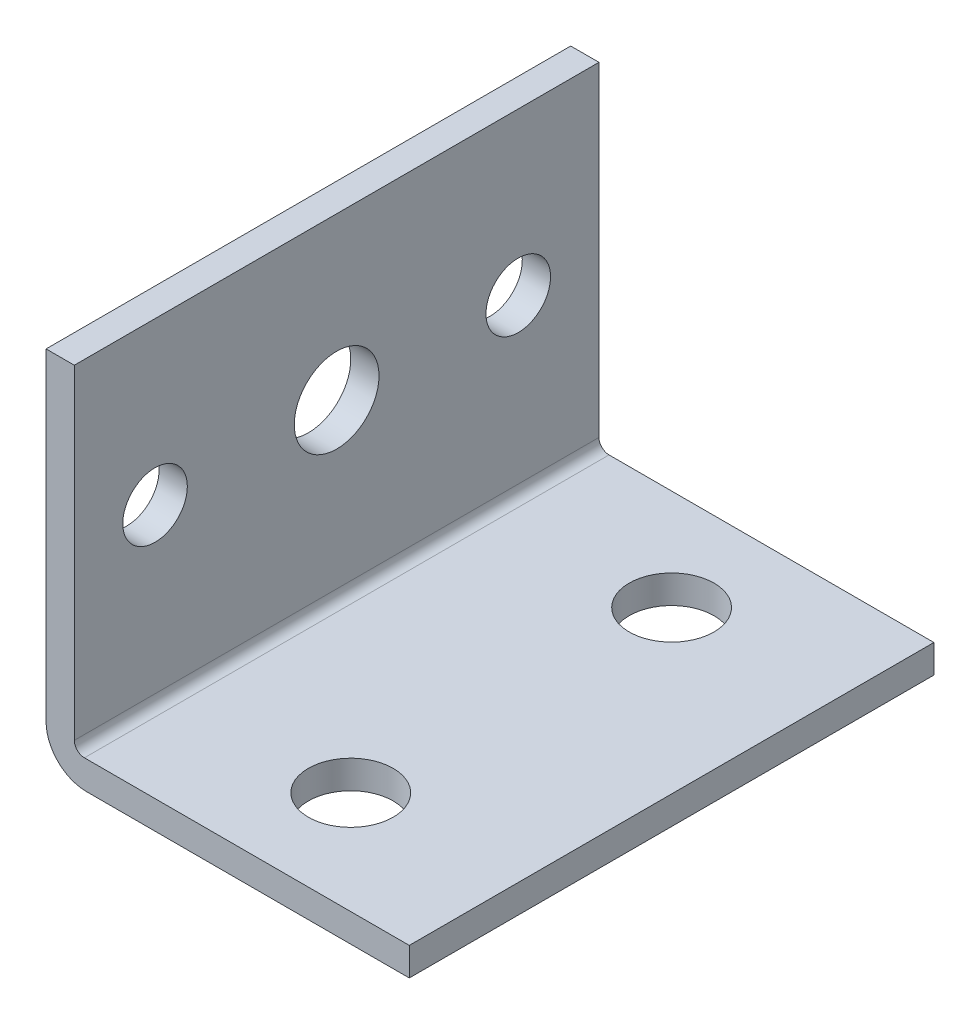
ISO-10303-21;
HEADER;
FILE_DESCRIPTION(('STEP AP214'),'2;1');
FILE_NAME('part.step','',(''),(''),'','','');
FILE_SCHEMA(('AUTOMOTIVE_DESIGN { 1 0 10303 214 1 1 1 1 }'));
ENDSEC;
DATA;
#1=APPLICATION_CONTEXT('core data for automotive mechanical design processes');
#2=APPLICATION_PROTOCOL_DEFINITION('international standard','automotive_design',2000,#1);
#3=PRODUCT_CONTEXT('',#1,'mechanical');
#4=PRODUCT('Part','Part','',(#3));
#5=PRODUCT_RELATED_PRODUCT_CATEGORY('part','',(#4));
#6=PRODUCT_DEFINITION_FORMATION('','',#4);
#7=PRODUCT_DEFINITION_CONTEXT('part definition',#1,'design');
#8=PRODUCT_DEFINITION('design','',#6,#7);
#9=PRODUCT_DEFINITION_SHAPE('','',#8);
#10=(LENGTH_UNIT() NAMED_UNIT(*) SI_UNIT(.MILLI.,.METRE.));
#11=(NAMED_UNIT(*) PLANE_ANGLE_UNIT() SI_UNIT($,.RADIAN.));
#12=(NAMED_UNIT(*) SI_UNIT($,.STERADIAN.) SOLID_ANGLE_UNIT());
#13=UNCERTAINTY_MEASURE_WITH_UNIT(LENGTH_MEASURE(1.E-05),#10,'distance_accuracy_value','');
#14=(GEOMETRIC_REPRESENTATION_CONTEXT(3) GLOBAL_UNCERTAINTY_ASSIGNED_CONTEXT((#13)) GLOBAL_UNIT_ASSIGNED_CONTEXT((#10,
#11,#12)) REPRESENTATION_CONTEXT('',''));
#15=CARTESIAN_POINT('',(0.,0.,0.));
#16=DIRECTION('',(0.,0.,1.));
#17=DIRECTION('',(1.,0.,0.));
#18=AXIS2_PLACEMENT_3D('',#15,#16,#17);
#19=CARTESIAN_POINT('',(0.,-15.7109360589494,-66.04));
#20=DIRECTION('',(0.,-1.,0.));
#21=DIRECTION('',(0.,0.,-1.));
#22=AXIS2_PLACEMENT_3D('',#19,#20,#21);
#23=PLANE('',#22);
#24=CARTESIAN_POINT('',(4.76580936534349,-15.7109360589494,-53.34));
#25=DIRECTION('',(0.,-1.,0.));
#26=DIRECTION('',(0.,0.,-1.));
#27=AXIS2_PLACEMENT_3D('',#24,#25,#26);
#28=CIRCLE('',#27,5.334);
#29=CARTESIAN_POINT('',(4.76580936534349,-15.7109360589494,-58.674));
#30=VERTEX_POINT('',#29);
#31=EDGE_CURVE('E263',#30,#30,#28,.T.);
#32=ORIENTED_EDGE('',*,*,#31,.T.);
#33=EDGE_LOOP('',(#32));
#34=FACE_BOUND('',#33,.T.);
#35=CARTESIAN_POINT('',(4.76580936534349,-15.7109360589494,-12.954));
#36=DIRECTION('',(0.,-1.,0.));
#37=DIRECTION('',(0.,0.,-1.));
#38=AXIS2_PLACEMENT_3D('',#35,#36,#37);
#39=CIRCLE('',#38,5.334);
#40=CARTESIAN_POINT('',(4.76580936534349,-15.7109360589494,-18.288));
#41=VERTEX_POINT('',#40);
#42=EDGE_CURVE('E163',#41,#41,#39,.T.);
#43=ORIENTED_EDGE('',*,*,#42,.T.);
#44=EDGE_LOOP('',(#43));
#45=FACE_BOUND('',#44,.T.);
#46=DIRECTION('',(1.,0.,0.));
#47=VECTOR('',#46,1.);
#48=CARTESIAN_POINT('',(0.,-15.7109360589494,-66.04));
#49=LINE('',#48,#47);
#50=CARTESIAN_POINT('',(-15.8081906346565,-15.7109360589494,-66.04));
#51=VERTEX_POINT('',#50);
#52=CARTESIAN_POINT('',(25.0858093653435,-15.7109360589494,-66.04));
#53=VERTEX_POINT('',#52);
#54=EDGE_CURVE('E111',#51,#53,#49,.T.);
#55=ORIENTED_EDGE('',*,*,#54,.F.);
#56=DIRECTION('',(0.,0.,1.));
#57=VECTOR('',#56,1.);
#58=CARTESIAN_POINT('',(-15.8081906346565,-15.7109360589494,-66.04));
#59=LINE('',#58,#57);
#60=CARTESIAN_POINT('',(-15.8081906346565,-15.7109360589494,0.));
#61=VERTEX_POINT('',#60);
#62=EDGE_CURVE('E133',#51,#61,#59,.T.);
#63=ORIENTED_EDGE('',*,*,#62,.T.);
#64=DIRECTION('',(1.,0.,0.));
#65=VECTOR('',#64,1.);
#66=CARTESIAN_POINT('',(0.,-15.7109360589494,0.));
#67=LINE('',#66,#65);
#68=CARTESIAN_POINT('',(25.0858093653435,-15.7109360589494,0.));
#69=VERTEX_POINT('',#68);
#70=EDGE_CURVE('E149',#61,#69,#67,.T.);
#71=ORIENTED_EDGE('',*,*,#70,.T.);
#72=DIRECTION('',(0.,0.,1.));
#73=VECTOR('',#72,1.);
#74=CARTESIAN_POINT('',(25.0858093653435,-15.7109360589494,-66.04));
#75=LINE('',#74,#73);
#76=EDGE_CURVE('E136',#53,#69,#75,.T.);
#77=ORIENTED_EDGE('',*,*,#76,.F.);
#78=EDGE_LOOP('',(#55,#63,#71,#77));
#79=FACE_BOUND('',#78,.T.);
#80=ADVANCED_FACE('F34',(#34,#45,#79),#23,.F.);
#81=CARTESIAN_POINT('',(25.0858093653435,0.,-66.04));
#82=DIRECTION('',(1.,0.,0.));
#83=DIRECTION('',(0.,0.,-1.));
#84=AXIS2_PLACEMENT_3D('',#81,#82,#83);
#85=PLANE('',#84);
#86=DIRECTION('',(0.,1.,0.));
#87=VECTOR('',#86,1.);
#88=CARTESIAN_POINT('',(25.0858093653435,0.,0.));
#89=LINE('',#88,#87);
#90=CARTESIAN_POINT('',(25.0858093653435,-19.2669360589494,0.));
#91=VERTEX_POINT('',#90);
#92=EDGE_CURVE('E170',#91,#69,#89,.T.);
#93=ORIENTED_EDGE('',*,*,#92,.F.);
#94=DIRECTION('',(0.,0.,1.));
#95=VECTOR('',#94,1.);
#96=CARTESIAN_POINT('',(25.0858093653435,-19.2669360589494,-66.04));
#97=LINE('',#96,#95);
#98=CARTESIAN_POINT('',(25.0858093653435,-19.2669360589494,-66.04));
#99=VERTEX_POINT('',#98);
#100=EDGE_CURVE('E126',#99,#91,#97,.T.);
#101=ORIENTED_EDGE('',*,*,#100,.F.);
#102=DIRECTION('',(0.,1.,0.));
#103=VECTOR('',#102,1.);
#104=CARTESIAN_POINT('',(25.0858093653435,0.,-66.04));
#105=LINE('',#104,#103);
#106=EDGE_CURVE('E124',#99,#53,#105,.T.);
#107=ORIENTED_EDGE('',*,*,#106,.T.);
#108=ORIENTED_EDGE('',*,*,#76,.T.);
#109=EDGE_LOOP('',(#93,#101,#107,#108));
#110=FACE_BOUND('',#109,.T.);
#111=ADVANCED_FACE('F191',(#110),#85,.T.);
#112=CARTESIAN_POINT('',(0.,-19.2669360589494,-66.04));
#113=DIRECTION('',(0.,-1.,0.));
#114=DIRECTION('',(0.,0.,-1.));
#115=AXIS2_PLACEMENT_3D('',#112,#113,#114);
#116=PLANE('',#115);
#117=CARTESIAN_POINT('',(4.76580936534349,-19.2669360589494,-53.34));
#118=DIRECTION('',(0.,-1.,0.));
#119=DIRECTION('',(0.,0.,-1.));
#120=AXIS2_PLACEMENT_3D('',#117,#118,#119);
#121=CIRCLE('',#120,5.334);
#122=CARTESIAN_POINT('',(4.76580936534349,-19.2669360589494,-58.674));
#123=VERTEX_POINT('',#122);
#124=EDGE_CURVE('E261',#123,#123,#121,.T.);
#125=ORIENTED_EDGE('',*,*,#124,.F.);
#126=EDGE_LOOP('',(#125));
#127=FACE_BOUND('',#126,.T.);
#128=CARTESIAN_POINT('',(4.76580936534349,-19.2669360589494,-12.954));
#129=DIRECTION('',(0.,-1.,0.));
#130=DIRECTION('',(0.,0.,-1.));
#131=AXIS2_PLACEMENT_3D('',#128,#129,#130);
#132=CIRCLE('',#131,5.334);
#133=CARTESIAN_POINT('',(4.76580936534349,-19.2669360589494,-18.288));
#134=VERTEX_POINT('',#133);
#135=EDGE_CURVE('E264',#134,#134,#132,.T.);
#136=ORIENTED_EDGE('',*,*,#135,.F.);
#137=EDGE_LOOP('',(#136));
#138=FACE_BOUND('',#137,.T.);
#139=DIRECTION('',(1.,0.,0.));
#140=VECTOR('',#139,1.);
#141=CARTESIAN_POINT('',(0.,-19.2669360589494,0.));
#142=LINE('',#141,#140);
#143=CARTESIAN_POINT('',(-15.5541906346565,-19.2669360589494,0.));
#144=VERTEX_POINT('',#143);
#145=EDGE_CURVE('E180',#144,#91,#142,.T.);
#146=ORIENTED_EDGE('',*,*,#145,.F.);
#147=DIRECTION('',(0.,0.,1.));
#148=VECTOR('',#147,1.);
#149=CARTESIAN_POINT('',(-15.5541906346565,-19.2669360589494,-66.04));
#150=LINE('',#149,#148);
#151=CARTESIAN_POINT('',(-15.5541906346565,-19.2669360589494,-66.04));
#152=VERTEX_POINT('',#151);
#153=EDGE_CURVE('E43',#144,#152,#150,.F.);
#154=ORIENTED_EDGE('',*,*,#153,.T.);
#155=DIRECTION('',(1.,0.,0.));
#156=VECTOR('',#155,1.);
#157=CARTESIAN_POINT('',(0.,-19.2669360589494,-66.04));
#158=LINE('',#157,#156);
#159=EDGE_CURVE('E129',#152,#99,#158,.T.);
#160=ORIENTED_EDGE('',*,*,#159,.T.);
#161=ORIENTED_EDGE('',*,*,#100,.T.);
#162=EDGE_LOOP('',(#146,#154,#160,#161));
#163=FACE_BOUND('',#162,.T.);
#164=ADVANCED_FACE('F188',(#127,#138,#163),#116,.T.);
#165=CARTESIAN_POINT('',(-20.6341906346565,0.,-66.04));
#166=DIRECTION('',(-1.,0.,0.));
#167=DIRECTION('',(0.,-1.,0.));
#168=AXIS2_PLACEMENT_3D('',#165,#166,#167);
#169=PLANE('',#168);
#170=CARTESIAN_POINT('',(-20.6341906346565,6.13306394105061,-55.88));
#171=DIRECTION('',(-1.,0.,0.));
#172=DIRECTION('',(0.,-1.,0.));
#173=AXIS2_PLACEMENT_3D('',#170,#171,#172);
#174=CIRCLE('',#173,4.064);
#175=CARTESIAN_POINT('',(-20.6341906346565,2.06906394105061,-55.88));
#176=VERTEX_POINT('',#175);
#177=EDGE_CURVE('E153',#176,#176,#174,.T.);
#178=ORIENTED_EDGE('',*,*,#177,.F.);
#179=EDGE_LOOP('',(#178));
#180=FACE_BOUND('',#179,.T.);
#181=CARTESIAN_POINT('',(-20.6341906346565,6.13306394105061,-10.16));
#182=DIRECTION('',(-1.,0.,0.));
#183=DIRECTION('',(0.,-1.,0.));
#184=AXIS2_PLACEMENT_3D('',#181,#182,#183);
#185=CIRCLE('',#184,4.064);
#186=CARTESIAN_POINT('',(-20.6341906346565,2.06906394105061,-10.16));
#187=VERTEX_POINT('',#186);
#188=EDGE_CURVE('E158',#187,#187,#185,.T.);
#189=ORIENTED_EDGE('',*,*,#188,.F.);
#190=EDGE_LOOP('',(#189));
#191=FACE_BOUND('',#190,.T.);
#192=CARTESIAN_POINT('',(-20.6341906346565,6.13306394105061,-33.02));
#193=DIRECTION('',(-1.,0.,0.));
#194=DIRECTION('',(0.,-1.,0.));
#195=AXIS2_PLACEMENT_3D('',#192,#193,#194);
#196=CIRCLE('',#195,5.334);
#197=CARTESIAN_POINT('',(-20.6341906346565,0.799063941050615,-33.02));
#198=VERTEX_POINT('',#197);
#199=EDGE_CURVE('E150',#198,#198,#196,.T.);
#200=ORIENTED_EDGE('',*,*,#199,.F.);
#201=EDGE_LOOP('',(#200));
#202=FACE_BOUND('',#201,.T.);
#203=DIRECTION('',(0.,-1.,0.));
#204=VECTOR('',#203,1.);
#205=CARTESIAN_POINT('',(-20.6341906346565,0.,-66.04));
#206=LINE('',#205,#204);
#207=CARTESIAN_POINT('',(-20.6341906346565,26.4530639410506,-66.04));
#208=VERTEX_POINT('',#207);
#209=CARTESIAN_POINT('',(-20.6341906346565,-14.1869360589494,-66.04));
#210=VERTEX_POINT('',#209);
#211=EDGE_CURVE('E117',#208,#210,#206,.T.);
#212=ORIENTED_EDGE('',*,*,#211,.T.);
#213=DIRECTION('',(0.,0.,1.));
#214=VECTOR('',#213,1.);
#215=CARTESIAN_POINT('',(-20.6341906346565,-14.1869360589494,-66.04));
#216=LINE('',#215,#214);
#217=CARTESIAN_POINT('',(-20.6341906346565,-14.1869360589494,0.));
#218=VERTEX_POINT('',#217);
#219=EDGE_CURVE('E142',#210,#218,#216,.T.);
#220=ORIENTED_EDGE('',*,*,#219,.T.);
#221=DIRECTION('',(0.,-1.,0.));
#222=VECTOR('',#221,1.);
#223=CARTESIAN_POINT('',(-20.6341906346565,0.,0.));
#224=LINE('',#223,#222);
#225=CARTESIAN_POINT('',(-20.6341906346565,26.4530639410506,0.));
#226=VERTEX_POINT('',#225);
#227=EDGE_CURVE('E178',#226,#218,#224,.T.);
#228=ORIENTED_EDGE('',*,*,#227,.F.);
#229=DIRECTION('',(0.,0.,1.));
#230=VECTOR('',#229,1.);
#231=CARTESIAN_POINT('',(-20.6341906346565,26.4530639410506,-66.04));
#232=LINE('',#231,#230);
#233=EDGE_CURVE('E123',#208,#226,#232,.T.);
#234=ORIENTED_EDGE('',*,*,#233,.F.);
#235=EDGE_LOOP('',(#212,#220,#228,#234));
#236=FACE_BOUND('',#235,.T.);
#237=ADVANCED_FACE('F205',(#180,#191,#202,#236),#169,.T.);
#238=CARTESIAN_POINT('',(0.,26.4530639410506,-66.04));
#239=DIRECTION('',(0.,-1.,0.));
#240=DIRECTION('',(0.,0.,-1.));
#241=AXIS2_PLACEMENT_3D('',#238,#239,#240);
#242=PLANE('',#241);
#243=DIRECTION('',(1.,0.,0.));
#244=VECTOR('',#243,1.);
#245=CARTESIAN_POINT('',(0.,26.4530639410506,0.));
#246=LINE('',#245,#244);
#247=CARTESIAN_POINT('',(-17.0781906346565,26.4530639410506,0.));
#248=VERTEX_POINT('',#247);
#249=EDGE_CURVE('E122',#226,#248,#246,.T.);
#250=ORIENTED_EDGE('',*,*,#249,.T.);
#251=DIRECTION('',(0.,0.,1.));
#252=VECTOR('',#251,1.);
#253=CARTESIAN_POINT('',(-17.0781906346565,26.4530639410506,-66.04));
#254=LINE('',#253,#252);
#255=CARTESIAN_POINT('',(-17.0781906346565,26.4530639410506,-66.04));
#256=VERTEX_POINT('',#255);
#257=EDGE_CURVE('E104',#256,#248,#254,.T.);
#258=ORIENTED_EDGE('',*,*,#257,.F.);
#259=DIRECTION('',(1.,0.,0.));
#260=VECTOR('',#259,1.);
#261=CARTESIAN_POINT('',(0.,26.4530639410506,-66.04));
#262=LINE('',#261,#260);
#263=EDGE_CURVE('E110',#208,#256,#262,.T.);
#264=ORIENTED_EDGE('',*,*,#263,.F.);
#265=ORIENTED_EDGE('',*,*,#233,.T.);
#266=EDGE_LOOP('',(#250,#258,#264,#265));
#267=FACE_BOUND('',#266,.T.);
#268=ADVANCED_FACE('F120',(#267),#242,.F.);
#269=CARTESIAN_POINT('',(-17.0781906346565,0.,-66.04));
#270=DIRECTION('',(1.,0.,0.));
#271=DIRECTION('',(0.,0.,-1.));
#272=AXIS2_PLACEMENT_3D('',#269,#270,#271);
#273=PLANE('',#272);
#274=CARTESIAN_POINT('',(-17.0781906346565,6.13306394105061,-55.88));
#275=DIRECTION('',(1.,0.,0.));
#276=DIRECTION('',(0.,0.,-1.));
#277=AXIS2_PLACEMENT_3D('',#274,#275,#276);
#278=CIRCLE('',#277,4.064);
#279=CARTESIAN_POINT('',(-17.0781906346565,6.13306394105061,-59.944));
#280=VERTEX_POINT('',#279);
#281=EDGE_CURVE('E38',#280,#280,#278,.T.);
#282=ORIENTED_EDGE('',*,*,#281,.F.);
#283=EDGE_LOOP('',(#282));
#284=FACE_BOUND('',#283,.T.);
#285=CARTESIAN_POINT('',(-17.0781906346565,6.13306394105061,-10.16));
#286=DIRECTION('',(1.,0.,0.));
#287=DIRECTION('',(0.,0.,-1.));
#288=AXIS2_PLACEMENT_3D('',#285,#286,#287);
#289=CIRCLE('',#288,4.064);
#290=CARTESIAN_POINT('',(-17.0781906346565,6.13306394105061,-14.224));
#291=VERTEX_POINT('',#290);
#292=EDGE_CURVE('E151',#291,#291,#289,.T.);
#293=ORIENTED_EDGE('',*,*,#292,.F.);
#294=EDGE_LOOP('',(#293));
#295=FACE_BOUND('',#294,.T.);
#296=CARTESIAN_POINT('',(-17.0781906346565,6.13306394105061,-33.02));
#297=DIRECTION('',(1.,0.,0.));
#298=DIRECTION('',(0.,0.,-1.));
#299=AXIS2_PLACEMENT_3D('',#296,#297,#298);
#300=CIRCLE('',#299,5.334);
#301=CARTESIAN_POINT('',(-17.0781906346565,6.13306394105061,-38.354));
#302=VERTEX_POINT('',#301);
#303=EDGE_CURVE('E147',#302,#302,#300,.T.);
#304=ORIENTED_EDGE('',*,*,#303,.F.);
#305=EDGE_LOOP('',(#304));
#306=FACE_BOUND('',#305,.T.);
#307=DIRECTION('',(0.,1.,0.));
#308=VECTOR('',#307,1.);
#309=CARTESIAN_POINT('',(-17.0781906346565,0.,0.));
#310=LINE('',#309,#308);
#311=CARTESIAN_POINT('',(-17.0781906346565,-14.4409360589494,0.));
#312=VERTEX_POINT('',#311);
#313=EDGE_CURVE('E175',#312,#248,#310,.T.);
#314=ORIENTED_EDGE('',*,*,#313,.F.);
#315=DIRECTION('',(0.,0.,1.));
#316=VECTOR('',#315,1.);
#317=CARTESIAN_POINT('',(-17.0781906346565,-14.4409360589494,-66.04));
#318=LINE('',#317,#316);
#319=CARTESIAN_POINT('',(-17.0781906346565,-14.4409360589494,-66.04));
#320=VERTEX_POINT('',#319);
#321=EDGE_CURVE('E107',#312,#320,#318,.F.);
#322=ORIENTED_EDGE('',*,*,#321,.T.);
#323=DIRECTION('',(0.,1.,0.));
#324=VECTOR('',#323,1.);
#325=CARTESIAN_POINT('',(-17.0781906346565,0.,-66.04));
#326=LINE('',#325,#324);
#327=EDGE_CURVE('E99',#320,#256,#326,.T.);
#328=ORIENTED_EDGE('',*,*,#327,.T.);
#329=ORIENTED_EDGE('',*,*,#257,.T.);
#330=EDGE_LOOP('',(#314,#322,#328,#329));
#331=FACE_BOUND('',#330,.T.);
#332=ADVANCED_FACE('F102',(#284,#295,#306,#331),#273,.T.);
#333=CARTESIAN_POINT('',(0.,0.,-66.04));
#334=DIRECTION('',(0.,0.,1.));
#335=DIRECTION('',(1.,0.,0.));
#336=AXIS2_PLACEMENT_3D('',#333,#334,#335);
#337=PLANE('',#336);
#338=ORIENTED_EDGE('',*,*,#159,.F.);
#339=CARTESIAN_POINT('',(-15.5541906346565,-14.1869360589494,-66.04));
#340=DIRECTION('',(0.,0.,1.));
#341=DIRECTION('',(1.,0.,0.));
#342=AXIS2_PLACEMENT_3D('',#339,#340,#341);
#343=CIRCLE('',#342,5.08);
#344=EDGE_CURVE('E11',#152,#210,#343,.F.);
#345=ORIENTED_EDGE('',*,*,#344,.T.);
#346=ORIENTED_EDGE('',*,*,#211,.F.);
#347=ORIENTED_EDGE('',*,*,#263,.T.);
#348=ORIENTED_EDGE('',*,*,#327,.F.);
#349=CARTESIAN_POINT('',(-15.8081906346565,-14.4409360589494,-66.04));
#350=DIRECTION('',(0.,0.,1.));
#351=DIRECTION('',(1.,0.,0.));
#352=AXIS2_PLACEMENT_3D('',#349,#350,#351);
#353=CIRCLE('',#352,1.27);
#354=EDGE_CURVE('E140',#320,#51,#353,.T.);
#355=ORIENTED_EDGE('',*,*,#354,.T.);
#356=ORIENTED_EDGE('',*,*,#54,.T.);
#357=ORIENTED_EDGE('',*,*,#106,.F.);
#358=EDGE_LOOP('',(#338,#345,#346,#347,#348,#355,#356,#357));
#359=FACE_BOUND('',#358,.T.);
#360=ADVANCED_FACE('F115',(#359),#337,.F.);
#361=CARTESIAN_POINT('',(0.,0.,0.));
#362=DIRECTION('',(0.,0.,1.));
#363=DIRECTION('',(1.,0.,0.));
#364=AXIS2_PLACEMENT_3D('',#361,#362,#363);
#365=PLANE('',#364);
#366=ORIENTED_EDGE('',*,*,#227,.T.);
#367=CARTESIAN_POINT('',(-15.5541906346565,-14.1869360589494,0.));
#368=DIRECTION('',(0.,0.,1.));
#369=DIRECTION('',(1.,0.,0.));
#370=AXIS2_PLACEMENT_3D('',#367,#368,#369);
#371=CIRCLE('',#370,5.08);
#372=EDGE_CURVE('E58',#218,#144,#371,.T.);
#373=ORIENTED_EDGE('',*,*,#372,.T.);
#374=ORIENTED_EDGE('',*,*,#145,.T.);
#375=ORIENTED_EDGE('',*,*,#92,.T.);
#376=ORIENTED_EDGE('',*,*,#70,.F.);
#377=CARTESIAN_POINT('',(-15.8081906346565,-14.4409360589494,0.));
#378=DIRECTION('',(0.,0.,1.));
#379=DIRECTION('',(1.,0.,0.));
#380=AXIS2_PLACEMENT_3D('',#377,#378,#379);
#381=CIRCLE('',#380,1.27);
#382=EDGE_CURVE('E138',#61,#312,#381,.F.);
#383=ORIENTED_EDGE('',*,*,#382,.T.);
#384=ORIENTED_EDGE('',*,*,#313,.T.);
#385=ORIENTED_EDGE('',*,*,#249,.F.);
#386=EDGE_LOOP('',(#366,#373,#374,#375,#376,#383,#384,#385));
#387=FACE_BOUND('',#386,.T.);
#388=ADVANCED_FACE('F194',(#387),#365,.T.);
#389=CARTESIAN_POINT('',(-15.8081906346565,-14.4409360589494,-66.04));
#390=DIRECTION('',(0.,0.,1.));
#391=DIRECTION('',(1.,0.,0.));
#392=AXIS2_PLACEMENT_3D('',#389,#390,#391);
#393=CYLINDRICAL_SURFACE('',#392,1.27);
#394=ORIENTED_EDGE('',*,*,#354,.F.);
#395=ORIENTED_EDGE('',*,*,#321,.F.);
#396=ORIENTED_EDGE('',*,*,#382,.F.);
#397=ORIENTED_EDGE('',*,*,#62,.F.);
#398=EDGE_LOOP('',(#394,#395,#396,#397));
#399=FACE_BOUND('',#398,.T.);
#400=ADVANCED_FACE('F199',(#399),#393,.F.);
#401=CARTESIAN_POINT('',(-15.5541906346565,-14.1869360589494,-66.04));
#402=DIRECTION('',(0.,0.,1.));
#403=DIRECTION('',(1.,0.,0.));
#404=AXIS2_PLACEMENT_3D('',#401,#402,#403);
#405=CYLINDRICAL_SURFACE('',#404,5.08);
#406=ORIENTED_EDGE('',*,*,#344,.F.);
#407=ORIENTED_EDGE('',*,*,#153,.F.);
#408=ORIENTED_EDGE('',*,*,#372,.F.);
#409=ORIENTED_EDGE('',*,*,#219,.F.);
#410=EDGE_LOOP('',(#406,#407,#408,#409));
#411=FACE_BOUND('',#410,.T.);
#412=ADVANCED_FACE('F36',(#411),#405,.T.);
#413=CARTESIAN_POINT('',(45.4058093653435,6.13306394105062,-33.02));
#414=DIRECTION('',(-1.,0.,0.));
#415=DIRECTION('',(0.,-1.,0.));
#416=AXIS2_PLACEMENT_3D('',#413,#414,#415);
#417=CYLINDRICAL_SURFACE('',#416,5.334);
#418=ORIENTED_EDGE('',*,*,#303,.T.);
#419=EDGE_LOOP('',(#418));
#420=FACE_BOUND('',#419,.T.);
#421=ORIENTED_EDGE('',*,*,#199,.T.);
#422=EDGE_LOOP('',(#421));
#423=FACE_BOUND('',#422,.T.);
#424=ADVANCED_FACE('F232',(#420,#423),#417,.F.);
#425=CARTESIAN_POINT('',(45.4058093653435,6.13306394105062,-10.16));
#426=DIRECTION('',(-1.,0.,0.));
#427=DIRECTION('',(0.,-1.,0.));
#428=AXIS2_PLACEMENT_3D('',#425,#426,#427);
#429=CYLINDRICAL_SURFACE('',#428,4.064);
#430=ORIENTED_EDGE('',*,*,#292,.T.);
#431=EDGE_LOOP('',(#430));
#432=FACE_BOUND('',#431,.T.);
#433=ORIENTED_EDGE('',*,*,#188,.T.);
#434=EDGE_LOOP('',(#433));
#435=FACE_BOUND('',#434,.T.);
#436=ADVANCED_FACE('F241',(#432,#435),#429,.F.);
#437=CARTESIAN_POINT('',(45.4058093653435,6.13306394105062,-55.88));
#438=DIRECTION('',(-1.,0.,0.));
#439=DIRECTION('',(0.,-1.,0.));
#440=AXIS2_PLACEMENT_3D('',#437,#438,#439);
#441=CYLINDRICAL_SURFACE('',#440,4.064);
#442=ORIENTED_EDGE('',*,*,#281,.T.);
#443=EDGE_LOOP('',(#442));
#444=FACE_BOUND('',#443,.T.);
#445=ORIENTED_EDGE('',*,*,#177,.T.);
#446=EDGE_LOOP('',(#445));
#447=FACE_BOUND('',#446,.T.);
#448=ADVANCED_FACE('F245',(#444,#447),#441,.F.);
#449=CARTESIAN_POINT('',(4.76580936534349,46.7730639410506,-12.954));
#450=DIRECTION('',(0.,-1.,0.));
#451=DIRECTION('',(0.,0.,-1.));
#452=AXIS2_PLACEMENT_3D('',#449,#450,#451);
#453=CYLINDRICAL_SURFACE('',#452,5.334);
#454=ORIENTED_EDGE('',*,*,#135,.T.);
#455=EDGE_LOOP('',(#454));
#456=FACE_BOUND('',#455,.T.);
#457=ORIENTED_EDGE('',*,*,#42,.F.);
#458=EDGE_LOOP('',(#457));
#459=FACE_BOUND('',#458,.T.);
#460=ADVANCED_FACE('F248',(#456,#459),#453,.F.);
#461=CARTESIAN_POINT('',(4.76580936534349,46.7730639410506,-53.34));
#462=DIRECTION('',(0.,-1.,0.));
#463=DIRECTION('',(0.,0.,-1.));
#464=AXIS2_PLACEMENT_3D('',#461,#462,#463);
#465=CYLINDRICAL_SURFACE('',#464,5.334);
#466=ORIENTED_EDGE('',*,*,#124,.T.);
#467=EDGE_LOOP('',(#466));
#468=FACE_BOUND('',#467,.T.);
#469=ORIENTED_EDGE('',*,*,#31,.F.);
#470=EDGE_LOOP('',(#469));
#471=FACE_BOUND('',#470,.T.);
#472=ADVANCED_FACE('F252',(#468,#471),#465,.F.);
#473=CLOSED_SHELL('',(#80,#111,#164,#237,#268,#332,#360,#388,#400,#412,#424,#436,#448,#460,#472));
#474=MANIFOLD_SOLID_BREP('B2',#473);
#475=ADVANCED_BREP_SHAPE_REPRESENTATION('',(#18,#474),#14);
#476=SHAPE_DEFINITION_REPRESENTATION(#9,#475);
ENDSEC;
END-ISO-10303-21;
